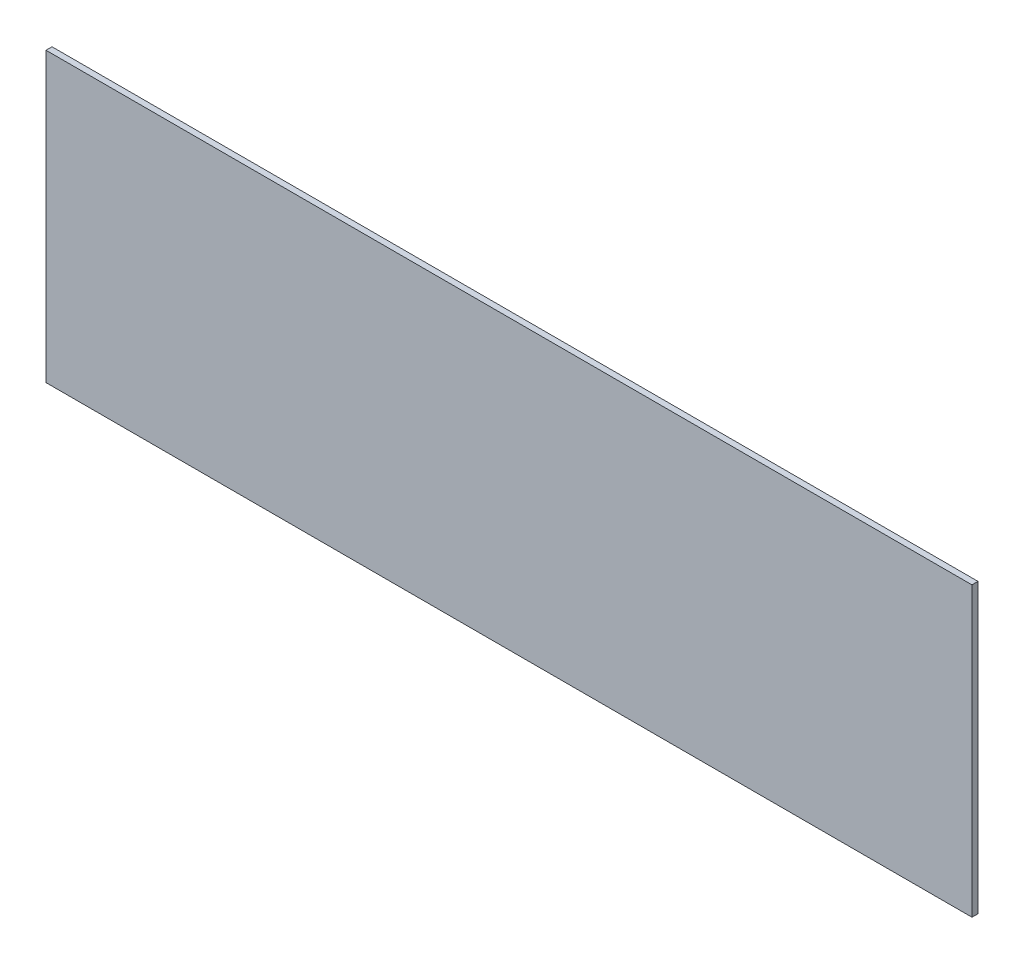
ISO-10303-21;
HEADER;
FILE_DESCRIPTION(('STEP AP214'),'2;1');
FILE_NAME('part.step','',(''),(''),'','','');
FILE_SCHEMA(('AUTOMOTIVE_DESIGN { 1 0 10303 214 1 1 1 1 }'));
ENDSEC;
DATA;
#1=APPLICATION_CONTEXT('core data for automotive mechanical design processes');
#2=APPLICATION_PROTOCOL_DEFINITION('international standard','automotive_design',2000,#1);
#3=PRODUCT_CONTEXT('',#1,'mechanical');
#4=PRODUCT('Part','Part','',(#3));
#5=PRODUCT_RELATED_PRODUCT_CATEGORY('part','',(#4));
#6=PRODUCT_DEFINITION_FORMATION('','',#4);
#7=PRODUCT_DEFINITION_CONTEXT('part definition',#1,'design');
#8=PRODUCT_DEFINITION('design','',#6,#7);
#9=PRODUCT_DEFINITION_SHAPE('','',#8);
#10=(LENGTH_UNIT() NAMED_UNIT(*) SI_UNIT(.MILLI.,.METRE.));
#11=(NAMED_UNIT(*) PLANE_ANGLE_UNIT() SI_UNIT($,.RADIAN.));
#12=(NAMED_UNIT(*) SI_UNIT($,.STERADIAN.) SOLID_ANGLE_UNIT());
#13=UNCERTAINTY_MEASURE_WITH_UNIT(LENGTH_MEASURE(1.E-05),#10,'distance_accuracy_value','');
#14=(GEOMETRIC_REPRESENTATION_CONTEXT(3) GLOBAL_UNCERTAINTY_ASSIGNED_CONTEXT((#13)) GLOBAL_UNIT_ASSIGNED_CONTEXT((#10,
#11,#12)) REPRESENTATION_CONTEXT('',''));
#15=CARTESIAN_POINT('',(0.,0.,0.));
#16=DIRECTION('',(0.,0.,1.));
#17=DIRECTION('',(1.,0.,0.));
#18=AXIS2_PLACEMENT_3D('',#15,#16,#17);
#19=CARTESIAN_POINT('',(230.,-71.5,3.));
#20=DIRECTION('',(0.,1.,0.));
#21=DIRECTION('',(0.,0.,1.));
#22=AXIS2_PLACEMENT_3D('',#19,#20,#21);
#23=PLANE('',#22);
#24=DIRECTION('',(1.,0.,0.));
#25=VECTOR('',#24,1.);
#26=CARTESIAN_POINT('',(230.,-71.5,0.));
#27=LINE('',#26,#25);
#28=CARTESIAN_POINT('',(-230.,-71.5,0.));
#29=VERTEX_POINT('',#28);
#30=CARTESIAN_POINT('',(230.,-71.5,0.));
#31=VERTEX_POINT('',#30);
#32=EDGE_CURVE('E97',#29,#31,#27,.T.);
#33=ORIENTED_EDGE('',*,*,#32,.T.);
#34=DIRECTION('',(0.,0.,-1.));
#35=VECTOR('',#34,1.);
#36=CARTESIAN_POINT('',(230.,-71.5,3.));
#37=LINE('',#36,#35);
#38=CARTESIAN_POINT('',(230.,-71.5,3.));
#39=VERTEX_POINT('',#38);
#40=EDGE_CURVE('E11',#39,#31,#37,.T.);
#41=ORIENTED_EDGE('',*,*,#40,.F.);
#42=DIRECTION('',(1.,0.,0.));
#43=VECTOR('',#42,1.);
#44=CARTESIAN_POINT('',(230.,-71.5,3.));
#45=LINE('',#44,#43);
#46=CARTESIAN_POINT('',(-230.,-71.5,3.));
#47=VERTEX_POINT('',#46);
#48=EDGE_CURVE('E83',#47,#39,#45,.T.);
#49=ORIENTED_EDGE('',*,*,#48,.F.);
#50=DIRECTION('',(0.,0.,-1.));
#51=VECTOR('',#50,1.);
#52=CARTESIAN_POINT('',(-230.,-71.5,3.));
#53=LINE('',#52,#51);
#54=EDGE_CURVE('E93',#47,#29,#53,.T.);
#55=ORIENTED_EDGE('',*,*,#54,.T.);
#56=EDGE_LOOP('',(#33,#41,#49,#55));
#57=FACE_BOUND('',#56,.T.);
#58=ADVANCED_FACE('F33',(#57),#23,.F.);
#59=CARTESIAN_POINT('',(230.,71.5,3.));
#60=DIRECTION('',(-1.,0.,0.));
#61=DIRECTION('',(0.,0.,1.));
#62=AXIS2_PLACEMENT_3D('',#59,#60,#61);
#63=PLANE('',#62);
#64=DIRECTION('',(0.,1.,0.));
#65=VECTOR('',#64,1.);
#66=CARTESIAN_POINT('',(230.,71.5,0.));
#67=LINE('',#66,#65);
#68=CARTESIAN_POINT('',(230.,71.5,0.));
#69=VERTEX_POINT('',#68);
#70=EDGE_CURVE('E88',#31,#69,#67,.T.);
#71=ORIENTED_EDGE('',*,*,#70,.T.);
#72=DIRECTION('',(0.,0.,-1.));
#73=VECTOR('',#72,1.);
#74=CARTESIAN_POINT('',(230.,71.5,3.));
#75=LINE('',#74,#73);
#76=CARTESIAN_POINT('',(230.,71.5,3.));
#77=VERTEX_POINT('',#76);
#78=EDGE_CURVE('E41',#77,#69,#75,.T.);
#79=ORIENTED_EDGE('',*,*,#78,.F.);
#80=DIRECTION('',(0.,1.,0.));
#81=VECTOR('',#80,1.);
#82=CARTESIAN_POINT('',(230.,71.5,3.));
#83=LINE('',#82,#81);
#84=EDGE_CURVE('E77',#39,#77,#83,.T.);
#85=ORIENTED_EDGE('',*,*,#84,.F.);
#86=ORIENTED_EDGE('',*,*,#40,.T.);
#87=EDGE_LOOP('',(#71,#79,#85,#86));
#88=FACE_BOUND('',#87,.T.);
#89=ADVANCED_FACE('F87',(#88),#63,.F.);
#90=CARTESIAN_POINT('',(-230.,71.5,3.));
#91=DIRECTION('',(0.,-1.,0.));
#92=DIRECTION('',(0.,0.,-1.));
#93=AXIS2_PLACEMENT_3D('',#90,#91,#92);
#94=PLANE('',#93);
#95=DIRECTION('',(-1.,0.,0.));
#96=VECTOR('',#95,1.);
#97=CARTESIAN_POINT('',(-230.,71.5,0.));
#98=LINE('',#97,#96);
#99=CARTESIAN_POINT('',(-230.,71.5,0.));
#100=VERTEX_POINT('',#99);
#101=EDGE_CURVE('E101',#69,#100,#98,.T.);
#102=ORIENTED_EDGE('',*,*,#101,.T.);
#103=DIRECTION('',(0.,0.,-1.));
#104=VECTOR('',#103,1.);
#105=CARTESIAN_POINT('',(-230.,71.5,3.));
#106=LINE('',#105,#104);
#107=CARTESIAN_POINT('',(-230.,71.5,3.));
#108=VERTEX_POINT('',#107);
#109=EDGE_CURVE('E90',#108,#100,#106,.T.);
#110=ORIENTED_EDGE('',*,*,#109,.F.);
#111=DIRECTION('',(-1.,0.,0.));
#112=VECTOR('',#111,1.);
#113=CARTESIAN_POINT('',(-230.,71.5,3.));
#114=LINE('',#113,#112);
#115=EDGE_CURVE('E80',#77,#108,#114,.T.);
#116=ORIENTED_EDGE('',*,*,#115,.F.);
#117=ORIENTED_EDGE('',*,*,#78,.T.);
#118=EDGE_LOOP('',(#102,#110,#116,#117));
#119=FACE_BOUND('',#118,.T.);
#120=ADVANCED_FACE('F91',(#119),#94,.F.);
#121=CARTESIAN_POINT('',(-230.,-71.5,3.));
#122=DIRECTION('',(1.,0.,0.));
#123=DIRECTION('',(0.,0.,-1.));
#124=AXIS2_PLACEMENT_3D('',#121,#122,#123);
#125=PLANE('',#124);
#126=DIRECTION('',(0.,-1.,0.));
#127=VECTOR('',#126,1.);
#128=CARTESIAN_POINT('',(-230.,-71.5,0.));
#129=LINE('',#128,#127);
#130=EDGE_CURVE('E66',#100,#29,#129,.T.);
#131=ORIENTED_EDGE('',*,*,#130,.T.);
#132=ORIENTED_EDGE('',*,*,#54,.F.);
#133=DIRECTION('',(0.,-1.,0.));
#134=VECTOR('',#133,1.);
#135=CARTESIAN_POINT('',(-230.,68.5,3.));
#136=LINE('',#135,#134);
#137=EDGE_CURVE('E49',#108,#47,#136,.T.);
#138=ORIENTED_EDGE('',*,*,#137,.F.);
#139=ORIENTED_EDGE('',*,*,#109,.T.);
#140=EDGE_LOOP('',(#131,#132,#138,#139));
#141=FACE_BOUND('',#140,.T.);
#142=ADVANCED_FACE('F105',(#141),#125,.F.);
#143=CARTESIAN_POINT('',(0.,0.,3.));
#144=DIRECTION('',(0.,0.,-1.));
#145=DIRECTION('',(-1.,0.,0.));
#146=AXIS2_PLACEMENT_3D('',#143,#144,#145);
#147=PLANE('',#146);
#148=ORIENTED_EDGE('',*,*,#48,.T.);
#149=ORIENTED_EDGE('',*,*,#84,.T.);
#150=ORIENTED_EDGE('',*,*,#115,.T.);
#151=ORIENTED_EDGE('',*,*,#137,.T.);
#152=EDGE_LOOP('',(#148,#149,#150,#151));
#153=FACE_BOUND('',#152,.T.);
#154=ADVANCED_FACE('F78',(#153),#147,.F.);
#155=CARTESIAN_POINT('',(0.,0.,0.));
#156=DIRECTION('',(0.,0.,-1.));
#157=DIRECTION('',(-1.,0.,0.));
#158=AXIS2_PLACEMENT_3D('',#155,#156,#157);
#159=PLANE('',#158);
#160=ORIENTED_EDGE('',*,*,#32,.F.);
#161=ORIENTED_EDGE('',*,*,#130,.F.);
#162=ORIENTED_EDGE('',*,*,#101,.F.);
#163=ORIENTED_EDGE('',*,*,#70,.F.);
#164=EDGE_LOOP('',(#160,#161,#162,#163));
#165=FACE_BOUND('',#164,.T.);
#166=ADVANCED_FACE('F107',(#165),#159,.T.);
#167=CLOSED_SHELL('',(#58,#89,#120,#142,#154,#166));
#168=MANIFOLD_SOLID_BREP('B2',#167);
#169=ADVANCED_BREP_SHAPE_REPRESENTATION('',(#18,#168),#14);
#170=SHAPE_DEFINITION_REPRESENTATION(#9,#169);
ENDSEC;
END-ISO-10303-21;
